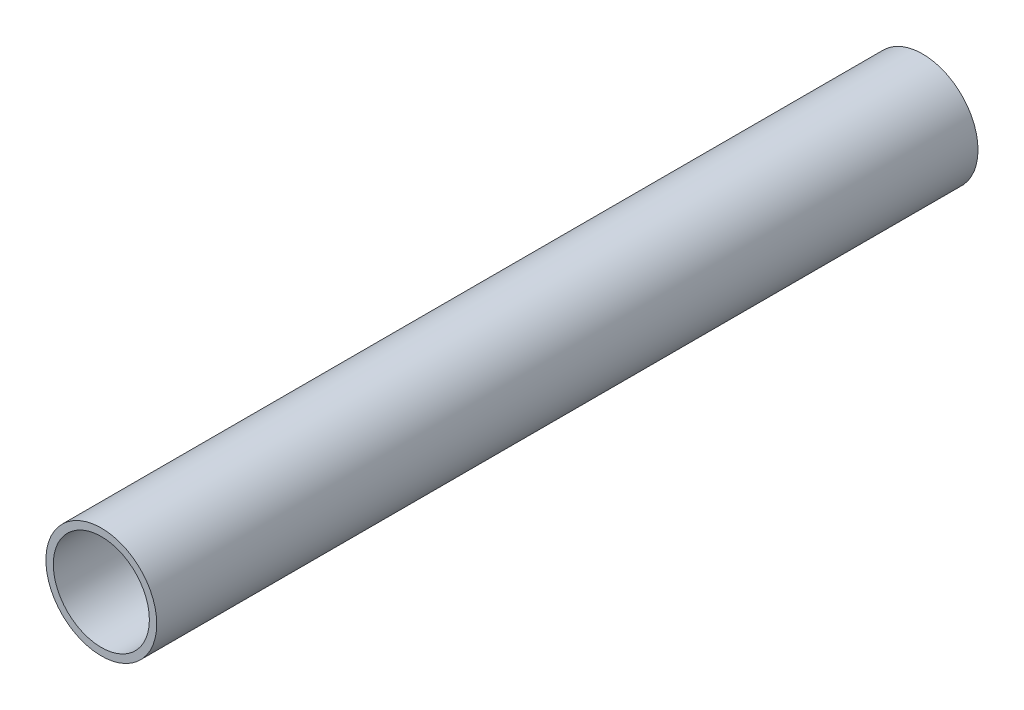
ISO-10303-21;
HEADER;
FILE_DESCRIPTION(('STEP AP214'),'2;1');
FILE_NAME('part.step','',(''),(''),'','','');
FILE_SCHEMA(('AUTOMOTIVE_DESIGN { 1 0 10303 214 1 1 1 1 }'));
ENDSEC;
DATA;
#1=APPLICATION_CONTEXT('core data for automotive mechanical design processes');
#2=APPLICATION_PROTOCOL_DEFINITION('international standard','automotive_design',2000,#1);
#3=PRODUCT_CONTEXT('',#1,'mechanical');
#4=PRODUCT('Part','Part','',(#3));
#5=PRODUCT_RELATED_PRODUCT_CATEGORY('part','',(#4));
#6=PRODUCT_DEFINITION_FORMATION('','',#4);
#7=PRODUCT_DEFINITION_CONTEXT('part definition',#1,'design');
#8=PRODUCT_DEFINITION('design','',#6,#7);
#9=PRODUCT_DEFINITION_SHAPE('','',#8);
#10=(LENGTH_UNIT() NAMED_UNIT(*) SI_UNIT(.MILLI.,.METRE.));
#11=(NAMED_UNIT(*) PLANE_ANGLE_UNIT() SI_UNIT($,.RADIAN.));
#12=(NAMED_UNIT(*) SI_UNIT($,.STERADIAN.) SOLID_ANGLE_UNIT());
#13=UNCERTAINTY_MEASURE_WITH_UNIT(LENGTH_MEASURE(1.E-05),#10,'distance_accuracy_value','');
#14=(GEOMETRIC_REPRESENTATION_CONTEXT(3) GLOBAL_UNCERTAINTY_ASSIGNED_CONTEXT((#13)) GLOBAL_UNIT_ASSIGNED_CONTEXT((#10,
#11,#12)) REPRESENTATION_CONTEXT('',''));
#15=CARTESIAN_POINT('',(0.,0.,0.));
#16=DIRECTION('',(0.,0.,1.));
#17=DIRECTION('',(1.,0.,0.));
#18=AXIS2_PLACEMENT_3D('',#15,#16,#17);
#19=CARTESIAN_POINT('',(0.,0.,200.));
#20=DIRECTION('',(0.,0.,1.));
#21=DIRECTION('',(1.,0.,0.));
#22=AXIS2_PLACEMENT_3D('',#19,#20,#21);
#23=PLANE('',#22);
#24=CARTESIAN_POINT('',(0.,0.,200.));
#25=DIRECTION('',(0.,0.,1.));
#26=DIRECTION('',(1.,0.,0.));
#27=AXIS2_PLACEMENT_3D('',#24,#25,#26);
#28=CIRCLE('',#27,13.5);
#29=CARTESIAN_POINT('',(13.5,0.,200.));
#30=VERTEX_POINT('',#29);
#31=EDGE_CURVE('E10',#30,#30,#28,.T.);
#32=ORIENTED_EDGE('',*,*,#31,.T.);
#33=EDGE_LOOP('',(#32));
#34=FACE_BOUND('',#33,.T.);
#35=CARTESIAN_POINT('',(0.,0.,200.));
#36=DIRECTION('',(0.,0.,1.));
#37=DIRECTION('',(1.,0.,0.));
#38=AXIS2_PLACEMENT_3D('',#35,#36,#37);
#39=CIRCLE('',#38,11.7);
#40=CARTESIAN_POINT('',(11.7,0.,200.));
#41=VERTEX_POINT('',#40);
#42=EDGE_CURVE('E44',#41,#41,#39,.T.);
#43=ORIENTED_EDGE('',*,*,#42,.F.);
#44=EDGE_LOOP('',(#43));
#45=FACE_BOUND('',#44,.T.);
#46=ADVANCED_FACE('F33',(#34,#45),#23,.T.);
#47=CARTESIAN_POINT('',(0.,0.,0.));
#48=DIRECTION('',(0.,0.,1.));
#49=DIRECTION('',(1.,0.,0.));
#50=AXIS2_PLACEMENT_3D('',#47,#48,#49);
#51=PLANE('',#50);
#52=CARTESIAN_POINT('',(0.,0.,0.));
#53=DIRECTION('',(0.,0.,1.));
#54=DIRECTION('',(1.,0.,0.));
#55=AXIS2_PLACEMENT_3D('',#52,#53,#54);
#56=CIRCLE('',#55,13.5);
#57=CARTESIAN_POINT('',(13.5,0.,0.));
#58=VERTEX_POINT('',#57);
#59=EDGE_CURVE('E37',#58,#58,#56,.T.);
#60=ORIENTED_EDGE('',*,*,#59,.F.);
#61=EDGE_LOOP('',(#60));
#62=FACE_BOUND('',#61,.T.);
#63=CARTESIAN_POINT('',(0.,0.,0.));
#64=DIRECTION('',(0.,0.,1.));
#65=DIRECTION('',(1.,0.,0.));
#66=AXIS2_PLACEMENT_3D('',#63,#64,#65);
#67=CIRCLE('',#66,11.7);
#68=CARTESIAN_POINT('',(11.7,0.,0.));
#69=VERTEX_POINT('',#68);
#70=EDGE_CURVE('E46',#69,#69,#67,.T.);
#71=ORIENTED_EDGE('',*,*,#70,.T.);
#72=EDGE_LOOP('',(#71));
#73=FACE_BOUND('',#72,.T.);
#74=ADVANCED_FACE('F56',(#62,#73),#51,.F.);
#75=CARTESIAN_POINT('',(0.,0.,200.));
#76=DIRECTION('',(0.,0.,-1.));
#77=DIRECTION('',(-1.,0.,0.));
#78=AXIS2_PLACEMENT_3D('',#75,#76,#77);
#79=CYLINDRICAL_SURFACE('',#78,13.5);
#80=ORIENTED_EDGE('',*,*,#31,.F.);
#81=EDGE_LOOP('',(#80));
#82=FACE_BOUND('',#81,.T.);
#83=ORIENTED_EDGE('',*,*,#59,.T.);
#84=EDGE_LOOP('',(#83));
#85=FACE_BOUND('',#84,.T.);
#86=ADVANCED_FACE('F35',(#82,#85),#79,.T.);
#87=CARTESIAN_POINT('',(0.,0.,200.));
#88=DIRECTION('',(0.,0.,-1.));
#89=DIRECTION('',(-1.,0.,0.));
#90=AXIS2_PLACEMENT_3D('',#87,#88,#89);
#91=CYLINDRICAL_SURFACE('',#90,11.7);
#92=ORIENTED_EDGE('',*,*,#42,.T.);
#93=EDGE_LOOP('',(#92));
#94=FACE_BOUND('',#93,.T.);
#95=ORIENTED_EDGE('',*,*,#70,.F.);
#96=EDGE_LOOP('',(#95));
#97=FACE_BOUND('',#96,.T.);
#98=ADVANCED_FACE('F52',(#94,#97),#91,.F.);
#99=CLOSED_SHELL('',(#46,#74,#86,#98));
#100=MANIFOLD_SOLID_BREP('B2',#99);
#101=ADVANCED_BREP_SHAPE_REPRESENTATION('',(#18,#100),#14);
#102=SHAPE_DEFINITION_REPRESENTATION(#9,#101);
ENDSEC;
END-ISO-10303-21;
